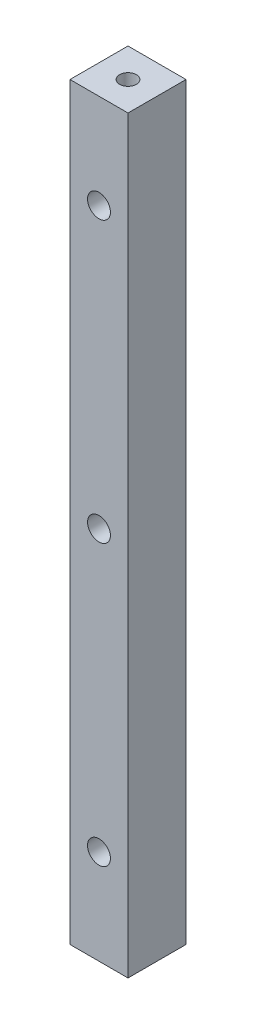
ISO-10303-21;
HEADER;
FILE_DESCRIPTION(('STEP AP214'),'2;1');
FILE_NAME('part.step','',(''),(''),'','','');
FILE_SCHEMA(('AUTOMOTIVE_DESIGN { 1 0 10303 214 1 1 1 1 }'));
ENDSEC;
DATA;
#1=APPLICATION_CONTEXT('core data for automotive mechanical design processes');
#2=APPLICATION_PROTOCOL_DEFINITION('international standard','automotive_design',2000,#1);
#3=PRODUCT_CONTEXT('',#1,'mechanical');
#4=PRODUCT('Part','Part','',(#3));
#5=PRODUCT_RELATED_PRODUCT_CATEGORY('part','',(#4));
#6=PRODUCT_DEFINITION_FORMATION('','',#4);
#7=PRODUCT_DEFINITION_CONTEXT('part definition',#1,'design');
#8=PRODUCT_DEFINITION('design','',#6,#7);
#9=PRODUCT_DEFINITION_SHAPE('','',#8);
#10=(LENGTH_UNIT() NAMED_UNIT(*) SI_UNIT(.MILLI.,.METRE.));
#11=(NAMED_UNIT(*) PLANE_ANGLE_UNIT() SI_UNIT($,.RADIAN.));
#12=(NAMED_UNIT(*) SI_UNIT($,.STERADIAN.) SOLID_ANGLE_UNIT());
#13=UNCERTAINTY_MEASURE_WITH_UNIT(LENGTH_MEASURE(1.E-05),#10,'distance_accuracy_value','');
#14=(GEOMETRIC_REPRESENTATION_CONTEXT(3) GLOBAL_UNCERTAINTY_ASSIGNED_CONTEXT((#13)) GLOBAL_UNIT_ASSIGNED_CONTEXT((#10,
#11,#12)) REPRESENTATION_CONTEXT('',''));
#15=CARTESIAN_POINT('',(0.,0.,0.));
#16=DIRECTION('',(0.,0.,1.));
#17=DIRECTION('',(1.,0.,0.));
#18=AXIS2_PLACEMENT_3D('',#15,#16,#17);
#19=CARTESIAN_POINT('',(5.7,147.2,-5.7));
#20=DIRECTION('',(-1.,0.,0.));
#21=DIRECTION('',(0.,0.,1.));
#22=AXIS2_PLACEMENT_3D('',#19,#20,#21);
#23=PLANE('',#22);
#24=DIRECTION('',(0.,0.,-1.));
#25=VECTOR('',#24,1.);
#26=CARTESIAN_POINT('',(5.7,0.,-5.7));
#27=LINE('',#26,#25);
#28=CARTESIAN_POINT('',(5.7,0.,5.7));
#29=VERTEX_POINT('',#28);
#30=CARTESIAN_POINT('',(5.7,0.,-5.7));
#31=VERTEX_POINT('',#30);
#32=EDGE_CURVE('E110',#29,#31,#27,.T.);
#33=ORIENTED_EDGE('',*,*,#32,.T.);
#34=DIRECTION('',(0.,-1.,0.));
#35=VECTOR('',#34,1.);
#36=CARTESIAN_POINT('',(5.7,147.2,-5.7));
#37=LINE('',#36,#35);
#38=CARTESIAN_POINT('',(5.7,147.2,-5.7));
#39=VERTEX_POINT('',#38);
#40=EDGE_CURVE('E11',#39,#31,#37,.T.);
#41=ORIENTED_EDGE('',*,*,#40,.F.);
#42=DIRECTION('',(0.,0.,-1.));
#43=VECTOR('',#42,1.);
#44=CARTESIAN_POINT('',(5.7,147.2,-5.7));
#45=LINE('',#44,#43);
#46=CARTESIAN_POINT('',(5.7,147.2,5.7));
#47=VERTEX_POINT('',#46);
#48=EDGE_CURVE('E111',#47,#39,#45,.T.);
#49=ORIENTED_EDGE('',*,*,#48,.F.);
#50=DIRECTION('',(0.,-1.,0.));
#51=VECTOR('',#50,1.);
#52=CARTESIAN_POINT('',(5.7,147.2,5.7));
#53=LINE('',#52,#51);
#54=EDGE_CURVE('E117',#47,#29,#53,.T.);
#55=ORIENTED_EDGE('',*,*,#54,.T.);
#56=EDGE_LOOP('',(#33,#41,#49,#55));
#57=FACE_BOUND('',#56,.T.);
#58=ADVANCED_FACE('F33',(#57),#23,.F.);
#59=CARTESIAN_POINT('',(-5.7,147.2,-5.7));
#60=DIRECTION('',(0.,0.,1.));
#61=DIRECTION('',(1.,0.,0.));
#62=AXIS2_PLACEMENT_3D('',#59,#60,#61);
#63=PLANE('',#62);
#64=CARTESIAN_POINT('',(0.,128.6,-5.7));
#65=DIRECTION('',(0.,0.,1.));
#66=DIRECTION('',(1.,0.,0.));
#67=AXIS2_PLACEMENT_3D('',#64,#65,#66);
#68=CIRCLE('',#67,2.25);
#69=CARTESIAN_POINT('',(2.25,128.6,-5.7));
#70=VERTEX_POINT('',#69);
#71=EDGE_CURVE('E162',#70,#70,#68,.T.);
#72=ORIENTED_EDGE('',*,*,#71,.T.);
#73=EDGE_LOOP('',(#72));
#74=FACE_BOUND('',#73,.T.);
#75=CARTESIAN_POINT('',(0.,73.6,-5.7));
#76=DIRECTION('',(0.,0.,1.));
#77=DIRECTION('',(1.,0.,0.));
#78=AXIS2_PLACEMENT_3D('',#75,#76,#77);
#79=CIRCLE('',#78,2.25);
#80=CARTESIAN_POINT('',(2.25,73.6,-5.7));
#81=VERTEX_POINT('',#80);
#82=EDGE_CURVE('E166',#81,#81,#79,.T.);
#83=ORIENTED_EDGE('',*,*,#82,.T.);
#84=EDGE_LOOP('',(#83));
#85=FACE_BOUND('',#84,.T.);
#86=CARTESIAN_POINT('',(0.,18.6,-5.7));
#87=DIRECTION('',(0.,0.,1.));
#88=DIRECTION('',(1.,0.,0.));
#89=AXIS2_PLACEMENT_3D('',#86,#87,#88);
#90=CIRCLE('',#89,2.25);
#91=CARTESIAN_POINT('',(2.25,18.6,-5.7));
#92=VERTEX_POINT('',#91);
#93=EDGE_CURVE('E104',#92,#92,#90,.T.);
#94=ORIENTED_EDGE('',*,*,#93,.T.);
#95=EDGE_LOOP('',(#94));
#96=FACE_BOUND('',#95,.T.);
#97=DIRECTION('',(-1.,0.,0.));
#98=VECTOR('',#97,1.);
#99=CARTESIAN_POINT('',(-5.7,0.,-5.7));
#100=LINE('',#99,#98);
#101=CARTESIAN_POINT('',(-5.7,0.,-5.7));
#102=VERTEX_POINT('',#101);
#103=EDGE_CURVE('E120',#31,#102,#100,.T.);
#104=ORIENTED_EDGE('',*,*,#103,.T.);
#105=DIRECTION('',(0.,-1.,0.));
#106=VECTOR('',#105,1.);
#107=CARTESIAN_POINT('',(-5.7,147.2,-5.7));
#108=LINE('',#107,#106);
#109=CARTESIAN_POINT('',(-5.7,147.2,-5.7));
#110=VERTEX_POINT('',#109);
#111=EDGE_CURVE('E41',#110,#102,#108,.T.);
#112=ORIENTED_EDGE('',*,*,#111,.F.);
#113=DIRECTION('',(-1.,0.,0.));
#114=VECTOR('',#113,1.);
#115=CARTESIAN_POINT('',(-5.7,147.2,-5.7));
#116=LINE('',#115,#114);
#117=EDGE_CURVE('E80',#39,#110,#116,.T.);
#118=ORIENTED_EDGE('',*,*,#117,.F.);
#119=ORIENTED_EDGE('',*,*,#40,.T.);
#120=EDGE_LOOP('',(#104,#112,#118,#119));
#121=FACE_BOUND('',#120,.T.);
#122=ADVANCED_FACE('F147',(#74,#85,#96,#121),#63,.F.);
#123=CARTESIAN_POINT('',(-5.7,147.2,-5.7));
#124=DIRECTION('',(1.,0.,0.));
#125=DIRECTION('',(0.,0.,-1.));
#126=AXIS2_PLACEMENT_3D('',#123,#124,#125);
#127=PLANE('',#126);
#128=DIRECTION('',(0.,0.,1.));
#129=VECTOR('',#128,1.);
#130=CARTESIAN_POINT('',(-5.7,0.,-5.7));
#131=LINE('',#130,#129);
#132=CARTESIAN_POINT('',(-5.7,0.,5.7));
#133=VERTEX_POINT('',#132);
#134=EDGE_CURVE('E67',#102,#133,#131,.T.);
#135=ORIENTED_EDGE('',*,*,#134,.T.);
#136=DIRECTION('',(0.,-1.,0.));
#137=VECTOR('',#136,1.);
#138=CARTESIAN_POINT('',(-5.7,147.2,5.7));
#139=LINE('',#138,#137);
#140=CARTESIAN_POINT('',(-5.7,147.2,5.7));
#141=VERTEX_POINT('',#140);
#142=EDGE_CURVE('E125',#141,#133,#139,.T.);
#143=ORIENTED_EDGE('',*,*,#142,.F.);
#144=DIRECTION('',(0.,0.,1.));
#145=VECTOR('',#144,1.);
#146=CARTESIAN_POINT('',(-5.7,147.2,-5.7));
#147=LINE('',#146,#145);
#148=EDGE_CURVE('E114',#110,#141,#147,.T.);
#149=ORIENTED_EDGE('',*,*,#148,.F.);
#150=ORIENTED_EDGE('',*,*,#111,.T.);
#151=EDGE_LOOP('',(#135,#143,#149,#150));
#152=FACE_BOUND('',#151,.T.);
#153=ADVANCED_FACE('F127',(#152),#127,.F.);
#154=CARTESIAN_POINT('',(-5.7,147.2,5.7));
#155=DIRECTION('',(0.,0.,-1.));
#156=DIRECTION('',(-1.,0.,0.));
#157=AXIS2_PLACEMENT_3D('',#154,#155,#156);
#158=PLANE('',#157);
#159=CARTESIAN_POINT('',(0.,128.6,5.7));
#160=DIRECTION('',(0.,0.,1.));
#161=DIRECTION('',(1.,0.,0.));
#162=AXIS2_PLACEMENT_3D('',#159,#160,#161);
#163=CIRCLE('',#162,2.24999999999999);
#164=CARTESIAN_POINT('',(2.24999999999999,128.6,5.7));
#165=VERTEX_POINT('',#164);
#166=EDGE_CURVE('E179',#165,#165,#163,.T.);
#167=ORIENTED_EDGE('',*,*,#166,.F.);
#168=EDGE_LOOP('',(#167));
#169=FACE_BOUND('',#168,.T.);
#170=CARTESIAN_POINT('',(0.,73.6,5.7));
#171=DIRECTION('',(0.,0.,1.));
#172=DIRECTION('',(1.,0.,0.));
#173=AXIS2_PLACEMENT_3D('',#170,#171,#172);
#174=CIRCLE('',#173,2.24999999999999);
#175=CARTESIAN_POINT('',(2.24999999999999,73.6,5.7));
#176=VERTEX_POINT('',#175);
#177=EDGE_CURVE('E175',#176,#176,#174,.T.);
#178=ORIENTED_EDGE('',*,*,#177,.F.);
#179=EDGE_LOOP('',(#178));
#180=FACE_BOUND('',#179,.T.);
#181=CARTESIAN_POINT('',(0.,18.6,5.7));
#182=DIRECTION('',(0.,0.,1.));
#183=DIRECTION('',(1.,0.,0.));
#184=AXIS2_PLACEMENT_3D('',#181,#182,#183);
#185=CIRCLE('',#184,2.24999999999999);
#186=CARTESIAN_POINT('',(2.24999999999999,18.6,5.7));
#187=VERTEX_POINT('',#186);
#188=EDGE_CURVE('E170',#187,#187,#185,.T.);
#189=ORIENTED_EDGE('',*,*,#188,.F.);
#190=EDGE_LOOP('',(#189));
#191=FACE_BOUND('',#190,.T.);
#192=DIRECTION('',(1.,0.,0.));
#193=VECTOR('',#192,1.);
#194=CARTESIAN_POINT('',(-5.7,0.,5.7));
#195=LINE('',#194,#193);
#196=EDGE_CURVE('E73',#133,#29,#195,.T.);
#197=ORIENTED_EDGE('',*,*,#196,.T.);
#198=ORIENTED_EDGE('',*,*,#54,.F.);
#199=DIRECTION('',(1.,0.,0.));
#200=VECTOR('',#199,1.);
#201=CARTESIAN_POINT('',(-5.7,147.2,5.7));
#202=LINE('',#201,#200);
#203=EDGE_CURVE('E49',#141,#47,#202,.T.);
#204=ORIENTED_EDGE('',*,*,#203,.F.);
#205=ORIENTED_EDGE('',*,*,#142,.T.);
#206=EDGE_LOOP('',(#197,#198,#204,#205));
#207=FACE_BOUND('',#206,.T.);
#208=ADVANCED_FACE('F134',(#169,#180,#191,#207),#158,.F.);
#209=CARTESIAN_POINT('',(5.7,147.2,5.7));
#210=DIRECTION('',(0.,1.,0.));
#211=DIRECTION('',(0.,0.,1.));
#212=AXIS2_PLACEMENT_3D('',#209,#210,#211);
#213=PLANE('',#212);
#214=CARTESIAN_POINT('',(0.,147.2,0.));
#215=DIRECTION('',(0.,1.,0.));
#216=DIRECTION('',(0.,0.,1.));
#217=AXIS2_PLACEMENT_3D('',#214,#215,#216);
#218=CIRCLE('',#217,1.64999999999999);
#219=CARTESIAN_POINT('',(0.,147.2,1.64999999999999));
#220=VERTEX_POINT('',#219);
#221=EDGE_CURVE('E97',#220,#220,#218,.T.);
#222=ORIENTED_EDGE('',*,*,#221,.F.);
#223=EDGE_LOOP('',(#222));
#224=FACE_BOUND('',#223,.T.);
#225=ORIENTED_EDGE('',*,*,#48,.T.);
#226=ORIENTED_EDGE('',*,*,#117,.T.);
#227=ORIENTED_EDGE('',*,*,#148,.T.);
#228=ORIENTED_EDGE('',*,*,#203,.T.);
#229=EDGE_LOOP('',(#225,#226,#227,#228));
#230=FACE_BOUND('',#229,.T.);
#231=ADVANCED_FACE('F136',(#224,#230),#213,.T.);
#232=CARTESIAN_POINT('',(5.7,0.,5.7));
#233=DIRECTION('',(0.,1.,0.));
#234=DIRECTION('',(0.,0.,1.));
#235=AXIS2_PLACEMENT_3D('',#232,#233,#234);
#236=PLANE('',#235);
#237=CARTESIAN_POINT('',(0.,0.,0.));
#238=DIRECTION('',(0.,-1.,0.));
#239=DIRECTION('',(0.,0.,-1.));
#240=AXIS2_PLACEMENT_3D('',#237,#238,#239);
#241=CIRCLE('',#240,1.64999999999999);
#242=CARTESIAN_POINT('',(0.,0.,-1.64999999999999));
#243=VERTEX_POINT('',#242);
#244=EDGE_CURVE('E98',#243,#243,#241,.T.);
#245=ORIENTED_EDGE('',*,*,#244,.F.);
#246=EDGE_LOOP('',(#245));
#247=FACE_BOUND('',#246,.T.);
#248=ORIENTED_EDGE('',*,*,#32,.F.);
#249=ORIENTED_EDGE('',*,*,#196,.F.);
#250=ORIENTED_EDGE('',*,*,#134,.F.);
#251=ORIENTED_EDGE('',*,*,#103,.F.);
#252=EDGE_LOOP('',(#248,#249,#250,#251));
#253=FACE_BOUND('',#252,.T.);
#254=ADVANCED_FACE('F130',(#247,#253),#236,.F.);
#255=CARTESIAN_POINT('',(0.,135.7,0.));
#256=DIRECTION('',(0.,1.,0.));
#257=DIRECTION('',(0.,0.,1.));
#258=AXIS2_PLACEMENT_3D('',#255,#256,#257);
#259=CONICAL_SURFACE('',#258,1.64999999999999,1.02974425867666);
#260=CARTESIAN_POINT('',(0.,134.708579978605,0.));
#261=VERTEX_POINT('',#260);
#262=VERTEX_LOOP('',#261);
#263=FACE_BOUND('',#262,.T.);
#264=CARTESIAN_POINT('',(0.,135.7,0.));
#265=DIRECTION('',(0.,1.,0.));
#266=DIRECTION('',(0.,0.,1.));
#267=AXIS2_PLACEMENT_3D('',#264,#265,#266);
#268=CIRCLE('',#267,1.64999999999999);
#269=CARTESIAN_POINT('',(0.,135.7,1.64999999999999));
#270=VERTEX_POINT('',#269);
#271=EDGE_CURVE('E101',#270,#270,#268,.T.);
#272=ORIENTED_EDGE('',*,*,#271,.T.);
#273=EDGE_LOOP('',(#272));
#274=FACE_BOUND('',#273,.T.);
#275=ADVANCED_FACE('F200',(#263,#274),#259,.F.);
#276=CARTESIAN_POINT('',(0.,147.2,0.));
#277=DIRECTION('',(0.,1.,0.));
#278=DIRECTION('',(0.,0.,1.));
#279=AXIS2_PLACEMENT_3D('',#276,#277,#278);
#280=CYLINDRICAL_SURFACE('',#279,1.64999999999999);
#281=ORIENTED_EDGE('',*,*,#271,.F.);
#282=EDGE_LOOP('',(#281));
#283=FACE_BOUND('',#282,.T.);
#284=ORIENTED_EDGE('',*,*,#221,.T.);
#285=EDGE_LOOP('',(#284));
#286=FACE_BOUND('',#285,.T.);
#287=ADVANCED_FACE('F91',(#283,#286),#280,.F.);
#288=CARTESIAN_POINT('',(0.,11.5,0.));
#289=DIRECTION('',(0.,-1.,0.));
#290=DIRECTION('',(0.,0.,-1.));
#291=AXIS2_PLACEMENT_3D('',#288,#289,#290);
#292=CONICAL_SURFACE('',#291,1.64999999999999,1.02974425867665);
#293=CARTESIAN_POINT('',(0.,12.4914200213955,0.));
#294=VERTEX_POINT('',#293);
#295=VERTEX_LOOP('',#294);
#296=FACE_BOUND('',#295,.T.);
#297=CARTESIAN_POINT('',(0.,11.5,0.));
#298=DIRECTION('',(0.,-1.,0.));
#299=DIRECTION('',(0.,0.,-1.));
#300=AXIS2_PLACEMENT_3D('',#297,#298,#299);
#301=CIRCLE('',#300,1.64999999999999);
#302=CARTESIAN_POINT('',(0.,11.5,-1.64999999999999));
#303=VERTEX_POINT('',#302);
#304=EDGE_CURVE('E95',#303,#303,#301,.T.);
#305=ORIENTED_EDGE('',*,*,#304,.T.);
#306=EDGE_LOOP('',(#305));
#307=FACE_BOUND('',#306,.T.);
#308=ADVANCED_FACE('F87',(#296,#307),#292,.F.);
#309=CARTESIAN_POINT('',(0.,0.,0.));
#310=DIRECTION('',(0.,-1.,0.));
#311=DIRECTION('',(0.,0.,-1.));
#312=AXIS2_PLACEMENT_3D('',#309,#310,#311);
#313=CYLINDRICAL_SURFACE('',#312,1.64999999999999);
#314=ORIENTED_EDGE('',*,*,#304,.F.);
#315=EDGE_LOOP('',(#314));
#316=FACE_BOUND('',#315,.T.);
#317=ORIENTED_EDGE('',*,*,#244,.T.);
#318=EDGE_LOOP('',(#317));
#319=FACE_BOUND('',#318,.T.);
#320=ADVANCED_FACE('F90',(#316,#319),#313,.F.);
#321=CARTESIAN_POINT('',(0.,18.6,5.7));
#322=DIRECTION('',(0.,0.,1.));
#323=DIRECTION('',(1.,0.,0.));
#324=AXIS2_PLACEMENT_3D('',#321,#322,#323);
#325=CYLINDRICAL_SURFACE('',#324,2.24999999999999);
#326=ORIENTED_EDGE('',*,*,#93,.F.);
#327=EDGE_LOOP('',(#326));
#328=FACE_BOUND('',#327,.T.);
#329=ORIENTED_EDGE('',*,*,#188,.T.);
#330=EDGE_LOOP('',(#329));
#331=FACE_BOUND('',#330,.T.);
#332=ADVANCED_FACE('F190',(#328,#331),#325,.F.);
#333=CARTESIAN_POINT('',(0.,73.6,5.7));
#334=DIRECTION('',(0.,0.,1.));
#335=DIRECTION('',(1.,0.,0.));
#336=AXIS2_PLACEMENT_3D('',#333,#334,#335);
#337=CYLINDRICAL_SURFACE('',#336,2.24999999999999);
#338=ORIENTED_EDGE('',*,*,#82,.F.);
#339=EDGE_LOOP('',(#338));
#340=FACE_BOUND('',#339,.T.);
#341=ORIENTED_EDGE('',*,*,#177,.T.);
#342=EDGE_LOOP('',(#341));
#343=FACE_BOUND('',#342,.T.);
#344=ADVANCED_FACE('F184',(#340,#343),#337,.F.);
#345=CARTESIAN_POINT('',(0.,128.6,5.7));
#346=DIRECTION('',(0.,0.,1.));
#347=DIRECTION('',(1.,0.,0.));
#348=AXIS2_PLACEMENT_3D('',#345,#346,#347);
#349=CYLINDRICAL_SURFACE('',#348,2.24999999999999);
#350=ORIENTED_EDGE('',*,*,#71,.F.);
#351=EDGE_LOOP('',(#350));
#352=FACE_BOUND('',#351,.T.);
#353=ORIENTED_EDGE('',*,*,#166,.T.);
#354=EDGE_LOOP('',(#353));
#355=FACE_BOUND('',#354,.T.);
#356=ADVANCED_FACE('F182',(#352,#355),#349,.F.);
#357=CLOSED_SHELL('',(#58,#122,#153,#208,#231,#254,#275,#287,#308,#320,#332,#344,#356));
#358=MANIFOLD_SOLID_BREP('B2',#357);
#359=ADVANCED_BREP_SHAPE_REPRESENTATION('',(#18,#358),#14);
#360=SHAPE_DEFINITION_REPRESENTATION(#9,#359);
ENDSEC;
END-ISO-10303-21;
